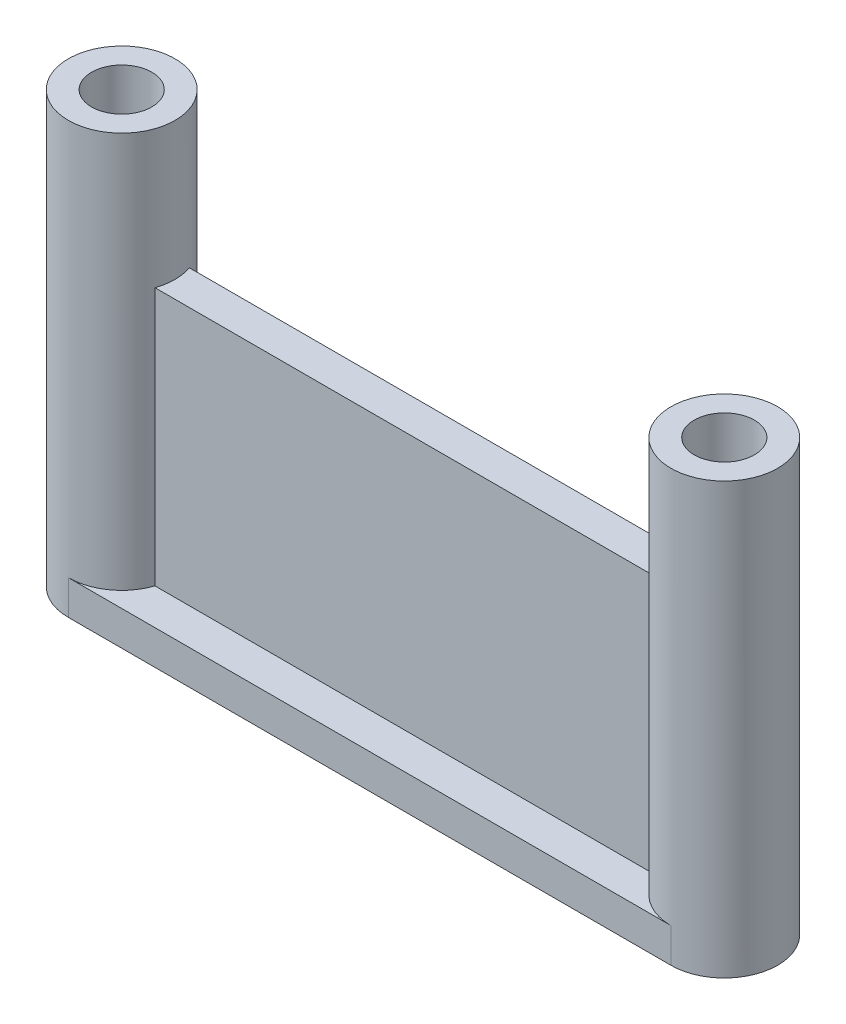
ISO-10303-21;
HEADER;
FILE_DESCRIPTION(('STEP AP214'),'2;1');
FILE_NAME('part.step','',(''),(''),'','','');
FILE_SCHEMA(('AUTOMOTIVE_DESIGN { 1 0 10303 214 1 1 1 1 }'));
ENDSEC;
DATA;
#1=APPLICATION_CONTEXT('core data for automotive mechanical design processes');
#2=APPLICATION_PROTOCOL_DEFINITION('international standard','automotive_design',2000,#1);
#3=PRODUCT_CONTEXT('',#1,'mechanical');
#4=PRODUCT('Part','Part','',(#3));
#5=PRODUCT_RELATED_PRODUCT_CATEGORY('part','',(#4));
#6=PRODUCT_DEFINITION_FORMATION('','',#4);
#7=PRODUCT_DEFINITION_CONTEXT('part definition',#1,'design');
#8=PRODUCT_DEFINITION('design','',#6,#7);
#9=PRODUCT_DEFINITION_SHAPE('','',#8);
#10=(LENGTH_UNIT() NAMED_UNIT(*) SI_UNIT(.MILLI.,.METRE.));
#11=(NAMED_UNIT(*) PLANE_ANGLE_UNIT() SI_UNIT($,.RADIAN.));
#12=(NAMED_UNIT(*) SI_UNIT($,.STERADIAN.) SOLID_ANGLE_UNIT());
#13=UNCERTAINTY_MEASURE_WITH_UNIT(LENGTH_MEASURE(1.E-05),#10,'distance_accuracy_value','');
#14=(GEOMETRIC_REPRESENTATION_CONTEXT(3) GLOBAL_UNCERTAINTY_ASSIGNED_CONTEXT((#13)) GLOBAL_UNIT_ASSIGNED_CONTEXT((#10,
#11,#12)) REPRESENTATION_CONTEXT('',''));
#15=CARTESIAN_POINT('',(0.,0.,0.));
#16=DIRECTION('',(0.,0.,1.));
#17=DIRECTION('',(1.,0.,0.));
#18=AXIS2_PLACEMENT_3D('',#15,#16,#17);
#19=CARTESIAN_POINT('',(-17.5,2.,0.));
#20=DIRECTION('',(0.,-1.,0.));
#21=DIRECTION('',(0.,0.,-1.));
#22=AXIS2_PLACEMENT_3D('',#19,#20,#21);
#23=PLANE('',#22);
#24=DIRECTION('',(1.,0.,0.));
#25=VECTOR('',#24,1.);
#26=CARTESIAN_POINT('',(15.0880260514746,2.,0.999999999999998));
#27=LINE('',#26,#25);
#28=CARTESIAN_POINT('',(-14.5657198497758,2.,1.));
#29=VERTEX_POINT('',#28);
#30=CARTESIAN_POINT('',(14.5657198497758,2.,0.999999999999999));
#31=VERTEX_POINT('',#30);
#32=EDGE_CURVE('E116',#29,#31,#27,.T.);
#33=ORIENTED_EDGE('',*,*,#32,.F.);
#34=CARTESIAN_POINT('',(-17.5,2.,0.));
#35=DIRECTION('',(0.,-1.,0.));
#36=DIRECTION('',(0.,0.,-1.));
#37=AXIS2_PLACEMENT_3D('',#34,#35,#36);
#38=CIRCLE('',#37,3.1);
#39=CARTESIAN_POINT('',(-17.5,2.,3.1));
#40=VERTEX_POINT('',#39);
#41=EDGE_CURVE('E149',#29,#40,#38,.T.);
#42=ORIENTED_EDGE('',*,*,#41,.T.);
#43=DIRECTION('',(-1.,0.,0.));
#44=VECTOR('',#43,1.);
#45=CARTESIAN_POINT('',(-17.5,2.,3.1));
#46=LINE('',#45,#44);
#47=CARTESIAN_POINT('',(17.5,2.,3.1));
#48=VERTEX_POINT('',#47);
#49=EDGE_CURVE('E134',#48,#40,#46,.T.);
#50=ORIENTED_EDGE('',*,*,#49,.F.);
#51=CARTESIAN_POINT('',(17.5,2.,0.));
#52=DIRECTION('',(0.,-1.,0.));
#53=DIRECTION('',(0.,0.,-1.));
#54=AXIS2_PLACEMENT_3D('',#51,#52,#53);
#55=CIRCLE('',#54,3.1);
#56=EDGE_CURVE('E123',#31,#48,#55,.F.);
#57=ORIENTED_EDGE('',*,*,#56,.F.);
#58=EDGE_LOOP('',(#33,#42,#50,#57));
#59=FACE_BOUND('',#58,.T.);
#60=ADVANCED_FACE('F35',(#59),#23,.F.);
#61=DIRECTION('',(-1.,0.,0.));
#62=VECTOR('',#61,1.);
#63=CARTESIAN_POINT('',(15.0880260514746,2.,-1.));
#64=LINE('',#63,#62);
#65=CARTESIAN_POINT('',(14.5657198497758,2.,-1.));
#66=VERTEX_POINT('',#65);
#67=CARTESIAN_POINT('',(-14.5657198497758,2.,-0.999999999999998));
#68=VERTEX_POINT('',#67);
#69=EDGE_CURVE('E104',#66,#68,#64,.T.);
#70=ORIENTED_EDGE('',*,*,#69,.F.);
#71=CARTESIAN_POINT('',(17.5,2.,-3.1));
#72=VERTEX_POINT('',#71);
#73=EDGE_CURVE('E114',#72,#66,#55,.F.);
#74=ORIENTED_EDGE('',*,*,#73,.F.);
#75=DIRECTION('',(1.,0.,0.));
#76=VECTOR('',#75,1.);
#77=CARTESIAN_POINT('',(-17.5,2.,-3.1));
#78=LINE('',#77,#76);
#79=CARTESIAN_POINT('',(-17.5,2.,-3.1));
#80=VERTEX_POINT('',#79);
#81=EDGE_CURVE('E132',#80,#72,#78,.T.);
#82=ORIENTED_EDGE('',*,*,#81,.F.);
#83=EDGE_CURVE('E58',#80,#68,#38,.T.);
#84=ORIENTED_EDGE('',*,*,#83,.T.);
#85=EDGE_LOOP('',(#70,#74,#82,#84));
#86=FACE_BOUND('',#85,.T.);
#87=ADVANCED_FACE('F112',(#86),#23,.F.);
#88=CARTESIAN_POINT('',(-17.5,25.,0.));
#89=DIRECTION('',(0.,-1.,0.));
#90=DIRECTION('',(0.,0.,-1.));
#91=AXIS2_PLACEMENT_3D('',#88,#89,#90);
#92=CYLINDRICAL_SURFACE('',#91,3.1);
#93=CARTESIAN_POINT('',(-17.5,25.,0.));
#94=DIRECTION('',(0.,1.,0.));
#95=DIRECTION('',(0.,0.,1.));
#96=AXIS2_PLACEMENT_3D('',#93,#94,#95);
#97=CIRCLE('',#96,3.1);
#98=CARTESIAN_POINT('',(-17.5,25.,3.1));
#99=VERTEX_POINT('',#98);
#100=EDGE_CURVE('E162',#99,#99,#97,.T.);
#101=ORIENTED_EDGE('',*,*,#100,.F.);
#102=EDGE_LOOP('',(#101));
#103=FACE_BOUND('',#102,.T.);
#104=DIRECTION('',(0.,-1.,0.));
#105=VECTOR('',#104,1.);
#106=CARTESIAN_POINT('',(-14.5657198497758,25.,1.));
#107=LINE('',#106,#105);
#108=CARTESIAN_POINT('',(-14.5657198497758,17.,1.));
#109=VERTEX_POINT('',#108);
#110=EDGE_CURVE('E174',#109,#29,#107,.T.);
#111=ORIENTED_EDGE('',*,*,#110,.F.);
#112=CARTESIAN_POINT('',(-17.5,17.,0.));
#113=DIRECTION('',(0.,-1.,0.));
#114=DIRECTION('',(0.,0.,-1.));
#115=AXIS2_PLACEMENT_3D('',#112,#113,#114);
#116=CIRCLE('',#115,3.1);
#117=CARTESIAN_POINT('',(-14.5657198497758,17.,-0.999999999999998));
#118=VERTEX_POINT('',#117);
#119=EDGE_CURVE('E169',#118,#109,#116,.T.);
#120=ORIENTED_EDGE('',*,*,#119,.F.);
#121=DIRECTION('',(0.,-1.,0.));
#122=VECTOR('',#121,1.);
#123=CARTESIAN_POINT('',(-14.5657198497758,25.,-0.999999999999998));
#124=LINE('',#123,#122);
#125=EDGE_CURVE('E172',#68,#118,#124,.F.);
#126=ORIENTED_EDGE('',*,*,#125,.F.);
#127=ORIENTED_EDGE('',*,*,#83,.F.);
#128=DIRECTION('',(0.,-1.,0.));
#129=VECTOR('',#128,1.);
#130=CARTESIAN_POINT('',(-17.5,2.,-3.1));
#131=LINE('',#130,#129);
#132=CARTESIAN_POINT('',(-17.5,0.,-3.1));
#133=VERTEX_POINT('',#132);
#134=EDGE_CURVE('E138',#80,#133,#131,.T.);
#135=ORIENTED_EDGE('',*,*,#134,.T.);
#136=CARTESIAN_POINT('',(-17.5,0.,0.));
#137=DIRECTION('',(0.,1.,0.));
#138=DIRECTION('',(0.,0.,1.));
#139=AXIS2_PLACEMENT_3D('',#136,#137,#138);
#140=CIRCLE('',#139,3.1);
#141=CARTESIAN_POINT('',(-17.5,0.,3.1));
#142=VERTEX_POINT('',#141);
#143=EDGE_CURVE('E159',#133,#142,#140,.T.);
#144=ORIENTED_EDGE('',*,*,#143,.T.);
#145=DIRECTION('',(0.,-1.,0.));
#146=VECTOR('',#145,1.);
#147=CARTESIAN_POINT('',(-17.5,2.,3.1));
#148=LINE('',#147,#146);
#149=EDGE_CURVE('E146',#40,#142,#148,.T.);
#150=ORIENTED_EDGE('',*,*,#149,.F.);
#151=ORIENTED_EDGE('',*,*,#41,.F.);
#152=EDGE_LOOP('',(#111,#120,#126,#127,#135,#144,#150,#151));
#153=FACE_BOUND('',#152,.T.);
#154=ADVANCED_FACE('F37',(#103,#153),#92,.T.);
#155=CARTESIAN_POINT('',(17.5,2.,0.));
#156=DIRECTION('',(0.,-1.,0.));
#157=DIRECTION('',(0.,0.,-1.));
#158=AXIS2_PLACEMENT_3D('',#155,#156,#157);
#159=CYLINDRICAL_SURFACE('',#158,3.1);
#160=CARTESIAN_POINT('',(17.5,25.,0.));
#161=DIRECTION('',(0.,1.,0.));
#162=DIRECTION('',(0.,0.,-1.));
#163=AXIS2_PLACEMENT_3D('',#160,#161,#162);
#164=CIRCLE('',#163,3.1);
#165=CARTESIAN_POINT('',(17.5,25.,-3.1));
#166=VERTEX_POINT('',#165);
#167=EDGE_CURVE('E128',#166,#166,#164,.T.);
#168=ORIENTED_EDGE('',*,*,#167,.F.);
#169=EDGE_LOOP('',(#168));
#170=FACE_BOUND('',#169,.T.);
#171=CARTESIAN_POINT('',(17.5,17.,0.));
#172=DIRECTION('',(0.,-1.,0.));
#173=DIRECTION('',(0.,0.,-1.));
#174=AXIS2_PLACEMENT_3D('',#171,#172,#173);
#175=CIRCLE('',#174,3.1);
#176=CARTESIAN_POINT('',(14.5657198497758,17.,-1.));
#177=VERTEX_POINT('',#176);
#178=CARTESIAN_POINT('',(14.5657198497758,17.,0.999999999999999));
#179=VERTEX_POINT('',#178);
#180=EDGE_CURVE('E110',#177,#179,#175,.F.);
#181=ORIENTED_EDGE('',*,*,#180,.T.);
#182=DIRECTION('',(0.,-1.,0.));
#183=VECTOR('',#182,1.);
#184=CARTESIAN_POINT('',(14.5657198497758,2.,0.999999999999999));
#185=LINE('',#184,#183);
#186=EDGE_CURVE('E11',#179,#31,#185,.T.);
#187=ORIENTED_EDGE('',*,*,#186,.T.);
#188=ORIENTED_EDGE('',*,*,#56,.T.);
#189=DIRECTION('',(0.,-1.,0.));
#190=VECTOR('',#189,1.);
#191=CARTESIAN_POINT('',(17.5,2.,3.1));
#192=LINE('',#191,#190);
#193=CARTESIAN_POINT('',(17.5,0.,3.1));
#194=VERTEX_POINT('',#193);
#195=EDGE_CURVE('E150',#48,#194,#192,.T.);
#196=ORIENTED_EDGE('',*,*,#195,.T.);
#197=CARTESIAN_POINT('',(17.5,0.,0.));
#198=DIRECTION('',(0.,-1.,0.));
#199=DIRECTION('',(0.,0.,-1.));
#200=AXIS2_PLACEMENT_3D('',#197,#198,#199);
#201=CIRCLE('',#200,3.1);
#202=CARTESIAN_POINT('',(17.5,0.,-3.1));
#203=VERTEX_POINT('',#202);
#204=EDGE_CURVE('E141',#203,#194,#201,.T.);
#205=ORIENTED_EDGE('',*,*,#204,.F.);
#206=DIRECTION('',(0.,-1.,0.));
#207=VECTOR('',#206,1.);
#208=CARTESIAN_POINT('',(17.5,2.,-3.1));
#209=LINE('',#208,#207);
#210=EDGE_CURVE('E120',#72,#203,#209,.T.);
#211=ORIENTED_EDGE('',*,*,#210,.F.);
#212=ORIENTED_EDGE('',*,*,#73,.T.);
#213=DIRECTION('',(0.,-1.,0.));
#214=VECTOR('',#213,1.);
#215=CARTESIAN_POINT('',(14.5657198497758,2.,-1.));
#216=LINE('',#215,#214);
#217=EDGE_CURVE('E43',#66,#177,#216,.F.);
#218=ORIENTED_EDGE('',*,*,#217,.T.);
#219=EDGE_LOOP('',(#181,#187,#188,#196,#205,#211,#212,#218));
#220=FACE_BOUND('',#219,.T.);
#221=ADVANCED_FACE('F118',(#170,#220),#159,.T.);
#222=CARTESIAN_POINT('',(-17.5,25.,0.));
#223=DIRECTION('',(0.,1.,0.));
#224=DIRECTION('',(0.,0.,1.));
#225=AXIS2_PLACEMENT_3D('',#222,#223,#224);
#226=PLANE('',#225);
#227=ORIENTED_EDGE('',*,*,#100,.T.);
#228=EDGE_LOOP('',(#227));
#229=FACE_BOUND('',#228,.T.);
#230=CARTESIAN_POINT('',(-17.5,25.,0.));
#231=DIRECTION('',(0.,1.,0.));
#232=DIRECTION('',(0.,0.,1.));
#233=AXIS2_PLACEMENT_3D('',#230,#231,#232);
#234=CIRCLE('',#233,1.75);
#235=CARTESIAN_POINT('',(-17.5,25.,1.75));
#236=VERTEX_POINT('',#235);
#237=EDGE_CURVE('E156',#236,#236,#234,.T.);
#238=ORIENTED_EDGE('',*,*,#237,.F.);
#239=EDGE_LOOP('',(#238));
#240=FACE_BOUND('',#239,.T.);
#241=ADVANCED_FACE('F190',(#229,#240),#226,.T.);
#242=CARTESIAN_POINT('',(-17.5,0.,0.));
#243=DIRECTION('',(0.,1.,0.));
#244=DIRECTION('',(0.,0.,1.));
#245=AXIS2_PLACEMENT_3D('',#242,#243,#244);
#246=PLANE('',#245);
#247=ORIENTED_EDGE('',*,*,#204,.T.);
#248=DIRECTION('',(-1.,0.,0.));
#249=VECTOR('',#248,1.);
#250=CARTESIAN_POINT('',(-17.5,0.,3.1));
#251=LINE('',#250,#249);
#252=EDGE_CURVE('E135',#194,#142,#251,.T.);
#253=ORIENTED_EDGE('',*,*,#252,.T.);
#254=ORIENTED_EDGE('',*,*,#143,.F.);
#255=DIRECTION('',(1.,0.,0.));
#256=VECTOR('',#255,1.);
#257=CARTESIAN_POINT('',(-17.5,0.,-3.1));
#258=LINE('',#257,#256);
#259=EDGE_CURVE('E126',#133,#203,#258,.T.);
#260=ORIENTED_EDGE('',*,*,#259,.T.);
#261=EDGE_LOOP('',(#247,#253,#254,#260));
#262=FACE_BOUND('',#261,.T.);
#263=CARTESIAN_POINT('',(17.5,0.,0.));
#264=DIRECTION('',(0.,-1.,0.));
#265=DIRECTION('',(0.,0.,-1.));
#266=AXIS2_PLACEMENT_3D('',#263,#264,#265);
#267=CIRCLE('',#266,1.75);
#268=CARTESIAN_POINT('',(17.5,0.,-1.75));
#269=VERTEX_POINT('',#268);
#270=EDGE_CURVE('E122',#269,#269,#267,.T.);
#271=ORIENTED_EDGE('',*,*,#270,.F.);
#272=EDGE_LOOP('',(#271));
#273=FACE_BOUND('',#272,.T.);
#274=CARTESIAN_POINT('',(-17.5,0.,0.));
#275=DIRECTION('',(0.,1.,0.));
#276=DIRECTION('',(0.,0.,1.));
#277=AXIS2_PLACEMENT_3D('',#274,#275,#276);
#278=CIRCLE('',#277,1.75);
#279=CARTESIAN_POINT('',(-17.5,0.,1.75));
#280=VERTEX_POINT('',#279);
#281=EDGE_CURVE('E155',#280,#280,#278,.T.);
#282=ORIENTED_EDGE('',*,*,#281,.T.);
#283=EDGE_LOOP('',(#282));
#284=FACE_BOUND('',#283,.T.);
#285=ADVANCED_FACE('F196',(#262,#273,#284),#246,.F.);
#286=CARTESIAN_POINT('',(-17.5,25.,0.));
#287=DIRECTION('',(0.,-1.,0.));
#288=DIRECTION('',(0.,0.,-1.));
#289=AXIS2_PLACEMENT_3D('',#286,#287,#288);
#290=CYLINDRICAL_SURFACE('',#289,1.75);
#291=ORIENTED_EDGE('',*,*,#281,.F.);
#292=EDGE_LOOP('',(#291));
#293=FACE_BOUND('',#292,.T.);
#294=ORIENTED_EDGE('',*,*,#237,.T.);
#295=EDGE_LOOP('',(#294));
#296=FACE_BOUND('',#295,.T.);
#297=ADVANCED_FACE('F215',(#293,#296),#290,.F.);
#298=CARTESIAN_POINT('',(-17.5,2.,3.1));
#299=DIRECTION('',(0.,0.,1.));
#300=DIRECTION('',(1.,0.,0.));
#301=AXIS2_PLACEMENT_3D('',#298,#299,#300);
#302=PLANE('',#301);
#303=ORIENTED_EDGE('',*,*,#252,.F.);
#304=ORIENTED_EDGE('',*,*,#195,.F.);
#305=ORIENTED_EDGE('',*,*,#49,.T.);
#306=ORIENTED_EDGE('',*,*,#149,.T.);
#307=EDGE_LOOP('',(#303,#304,#305,#306));
#308=FACE_BOUND('',#307,.T.);
#309=ADVANCED_FACE('F212',(#308),#302,.T.);
#310=CARTESIAN_POINT('',(-17.5,2.,-3.1));
#311=DIRECTION('',(0.,0.,-1.));
#312=DIRECTION('',(-1.,0.,0.));
#313=AXIS2_PLACEMENT_3D('',#310,#311,#312);
#314=PLANE('',#313);
#315=ORIENTED_EDGE('',*,*,#259,.F.);
#316=ORIENTED_EDGE('',*,*,#134,.F.);
#317=ORIENTED_EDGE('',*,*,#81,.T.);
#318=ORIENTED_EDGE('',*,*,#210,.T.);
#319=EDGE_LOOP('',(#315,#316,#317,#318));
#320=FACE_BOUND('',#319,.T.);
#321=ADVANCED_FACE('F214',(#320),#314,.T.);
#322=CARTESIAN_POINT('',(17.5,2.,0.));
#323=DIRECTION('',(0.,-1.,0.));
#324=DIRECTION('',(0.,0.,-1.));
#325=AXIS2_PLACEMENT_3D('',#322,#323,#324);
#326=CYLINDRICAL_SURFACE('',#325,1.75);
#327=ORIENTED_EDGE('',*,*,#270,.T.);
#328=EDGE_LOOP('',(#327));
#329=FACE_BOUND('',#328,.T.);
#330=CARTESIAN_POINT('',(17.5,25.,0.));
#331=DIRECTION('',(0.,1.,0.));
#332=DIRECTION('',(0.,0.,-1.));
#333=AXIS2_PLACEMENT_3D('',#330,#331,#332);
#334=CIRCLE('',#333,1.75);
#335=CARTESIAN_POINT('',(17.5,25.,-1.75));
#336=VERTEX_POINT('',#335);
#337=EDGE_CURVE('E179',#336,#336,#334,.T.);
#338=ORIENTED_EDGE('',*,*,#337,.T.);
#339=EDGE_LOOP('',(#338));
#340=FACE_BOUND('',#339,.T.);
#341=ADVANCED_FACE('F210',(#329,#340),#326,.F.);
#342=CARTESIAN_POINT('',(17.5,25.,0.));
#343=DIRECTION('',(0.,-1.,0.));
#344=DIRECTION('',(0.,0.,-1.));
#345=AXIS2_PLACEMENT_3D('',#342,#343,#344);
#346=PLANE('',#345);
#347=ORIENTED_EDGE('',*,*,#167,.T.);
#348=EDGE_LOOP('',(#347));
#349=FACE_BOUND('',#348,.T.);
#350=ORIENTED_EDGE('',*,*,#337,.F.);
#351=EDGE_LOOP('',(#350));
#352=FACE_BOUND('',#351,.T.);
#353=ADVANCED_FACE('F186',(#349,#352),#346,.F.);
#354=CARTESIAN_POINT('',(15.0880260514746,17.,0.999999999999998));
#355=DIRECTION('',(0.,0.,-1.));
#356=DIRECTION('',(-1.,0.,0.));
#357=AXIS2_PLACEMENT_3D('',#354,#355,#356);
#358=PLANE('',#357);
#359=DIRECTION('',(1.,0.,0.));
#360=VECTOR('',#359,1.);
#361=CARTESIAN_POINT('',(15.0880260514746,17.,0.999999999999998));
#362=LINE('',#361,#360);
#363=EDGE_CURVE('E50',#109,#179,#362,.T.);
#364=ORIENTED_EDGE('',*,*,#363,.F.);
#365=ORIENTED_EDGE('',*,*,#110,.T.);
#366=ORIENTED_EDGE('',*,*,#32,.T.);
#367=ORIENTED_EDGE('',*,*,#186,.F.);
#368=EDGE_LOOP('',(#364,#365,#366,#367));
#369=FACE_BOUND('',#368,.T.);
#370=ADVANCED_FACE('F233',(#369),#358,.F.);
#371=CARTESIAN_POINT('',(15.0880260514746,17.,-1.));
#372=DIRECTION('',(0.,0.,1.));
#373=DIRECTION('',(1.,0.,0.));
#374=AXIS2_PLACEMENT_3D('',#371,#372,#373);
#375=PLANE('',#374);
#376=ORIENTED_EDGE('',*,*,#69,.T.);
#377=ORIENTED_EDGE('',*,*,#125,.T.);
#378=DIRECTION('',(-1.,0.,0.));
#379=VECTOR('',#378,1.);
#380=CARTESIAN_POINT('',(15.0880260514746,17.,-1.));
#381=LINE('',#380,#379);
#382=EDGE_CURVE('E106',#177,#118,#381,.T.);
#383=ORIENTED_EDGE('',*,*,#382,.F.);
#384=ORIENTED_EDGE('',*,*,#217,.F.);
#385=EDGE_LOOP('',(#376,#377,#383,#384));
#386=FACE_BOUND('',#385,.T.);
#387=ADVANCED_FACE('F103',(#386),#375,.F.);
#388=CARTESIAN_POINT('',(0.,17.,0.));
#389=DIRECTION('',(0.,-1.,0.));
#390=DIRECTION('',(0.,0.,-1.));
#391=AXIS2_PLACEMENT_3D('',#388,#389,#390);
#392=PLANE('',#391);
#393=ORIENTED_EDGE('',*,*,#382,.T.);
#394=ORIENTED_EDGE('',*,*,#119,.T.);
#395=ORIENTED_EDGE('',*,*,#363,.T.);
#396=ORIENTED_EDGE('',*,*,#180,.F.);
#397=EDGE_LOOP('',(#393,#394,#395,#396));
#398=FACE_BOUND('',#397,.T.);
#399=ADVANCED_FACE('F167',(#398),#392,.F.);
#400=CLOSED_SHELL('',(#60,#87,#154,#221,#241,#285,#297,#309,#321,#341,#353,#370,#387,#399));
#401=MANIFOLD_SOLID_BREP('B2',#400);
#402=ADVANCED_BREP_SHAPE_REPRESENTATION('',(#18,#401),#14);
#403=SHAPE_DEFINITION_REPRESENTATION(#9,#402);
ENDSEC;
END-ISO-10303-21;
